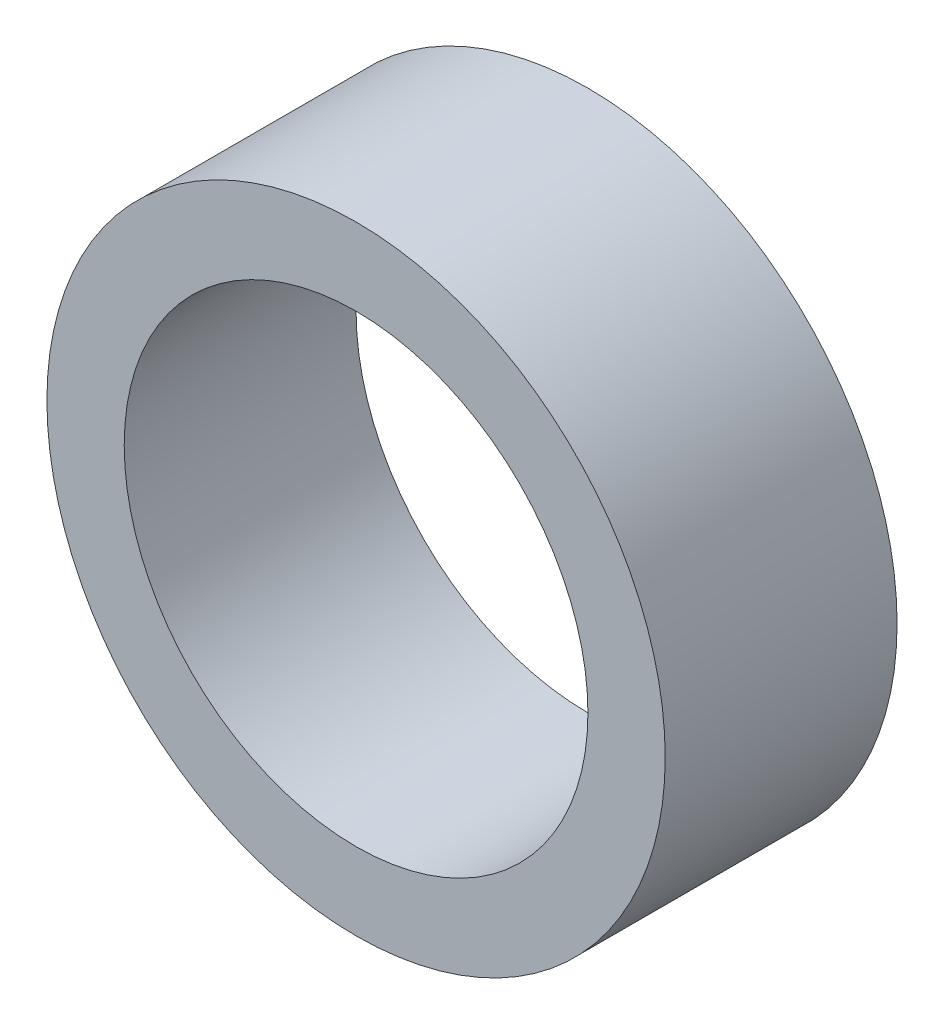
ISO-10303-21;
HEADER;
FILE_DESCRIPTION(('STEP AP214'),'2;1');
FILE_NAME('part.step','',(''),(''),'','','');
FILE_SCHEMA(('AUTOMOTIVE_DESIGN { 1 0 10303 214 1 1 1 1 }'));
ENDSEC;
DATA;
#1=APPLICATION_CONTEXT('core data for automotive mechanical design processes');
#2=APPLICATION_PROTOCOL_DEFINITION('international standard','automotive_design',2000,#1);
#3=PRODUCT_CONTEXT('',#1,'mechanical');
#4=PRODUCT('Part','Part','',(#3));
#5=PRODUCT_RELATED_PRODUCT_CATEGORY('part','',(#4));
#6=PRODUCT_DEFINITION_FORMATION('','',#4);
#7=PRODUCT_DEFINITION_CONTEXT('part definition',#1,'design');
#8=PRODUCT_DEFINITION('design','',#6,#7);
#9=PRODUCT_DEFINITION_SHAPE('','',#8);
#10=(LENGTH_UNIT() NAMED_UNIT(*) SI_UNIT(.MILLI.,.METRE.));
#11=(NAMED_UNIT(*) PLANE_ANGLE_UNIT() SI_UNIT($,.RADIAN.));
#12=(NAMED_UNIT(*) SI_UNIT($,.STERADIAN.) SOLID_ANGLE_UNIT());
#13=UNCERTAINTY_MEASURE_WITH_UNIT(LENGTH_MEASURE(1.E-05),#10,'distance_accuracy_value','');
#14=(GEOMETRIC_REPRESENTATION_CONTEXT(3) GLOBAL_UNCERTAINTY_ASSIGNED_CONTEXT((#13)) GLOBAL_UNIT_ASSIGNED_CONTEXT((#10,
#11,#12)) REPRESENTATION_CONTEXT('',''));
#15=CARTESIAN_POINT('',(0.,0.,0.));
#16=DIRECTION('',(0.,0.,1.));
#17=DIRECTION('',(1.,0.,0.));
#18=AXIS2_PLACEMENT_3D('',#15,#16,#17);
#19=CARTESIAN_POINT('',(0.,0.,9.525));
#20=DIRECTION('',(0.,0.,1.));
#21=DIRECTION('',(1.,0.,0.));
#22=AXIS2_PLACEMENT_3D('',#19,#20,#21);
#23=PLANE('',#22);
#24=CARTESIAN_POINT('',(0.,0.,9.525));
#25=DIRECTION('',(0.,0.,1.));
#26=DIRECTION('',(1.,0.,0.));
#27=AXIS2_PLACEMENT_3D('',#24,#25,#26);
#28=CIRCLE('',#27,12.7);
#29=CARTESIAN_POINT('',(12.7,0.,9.525));
#30=VERTEX_POINT('',#29);
#31=EDGE_CURVE('E10',#30,#30,#28,.T.);
#32=ORIENTED_EDGE('',*,*,#31,.T.);
#33=EDGE_LOOP('',(#32));
#34=FACE_BOUND('',#33,.T.);
#35=CARTESIAN_POINT('',(0.,0.,9.525));
#36=DIRECTION('',(0.,0.,1.));
#37=DIRECTION('',(1.,0.,0.));
#38=AXIS2_PLACEMENT_3D('',#35,#36,#37);
#39=CIRCLE('',#38,9.525);
#40=CARTESIAN_POINT('',(9.525,0.,9.525));
#41=VERTEX_POINT('',#40);
#42=EDGE_CURVE('E42',#41,#41,#39,.T.);
#43=ORIENTED_EDGE('',*,*,#42,.F.);
#44=EDGE_LOOP('',(#43));
#45=FACE_BOUND('',#44,.T.);
#46=ADVANCED_FACE('F31',(#34,#45),#23,.T.);
#47=CARTESIAN_POINT('',(0.,0.,0.));
#48=DIRECTION('',(0.,0.,1.));
#49=DIRECTION('',(1.,0.,0.));
#50=AXIS2_PLACEMENT_3D('',#47,#48,#49);
#51=PLANE('',#50);
#52=CARTESIAN_POINT('',(0.,0.,0.));
#53=DIRECTION('',(0.,0.,1.));
#54=DIRECTION('',(1.,0.,0.));
#55=AXIS2_PLACEMENT_3D('',#52,#53,#54);
#56=CIRCLE('',#55,12.7);
#57=CARTESIAN_POINT('',(12.7,0.,0.));
#58=VERTEX_POINT('',#57);
#59=EDGE_CURVE('E35',#58,#58,#56,.T.);
#60=ORIENTED_EDGE('',*,*,#59,.F.);
#61=EDGE_LOOP('',(#60));
#62=FACE_BOUND('',#61,.T.);
#63=CARTESIAN_POINT('',(0.,0.,0.));
#64=DIRECTION('',(0.,0.,1.));
#65=DIRECTION('',(1.,0.,0.));
#66=AXIS2_PLACEMENT_3D('',#63,#64,#65);
#67=CIRCLE('',#66,9.525);
#68=CARTESIAN_POINT('',(9.525,0.,0.));
#69=VERTEX_POINT('',#68);
#70=EDGE_CURVE('E44',#69,#69,#67,.T.);
#71=ORIENTED_EDGE('',*,*,#70,.T.);
#72=EDGE_LOOP('',(#71));
#73=FACE_BOUND('',#72,.T.);
#74=ADVANCED_FACE('F54',(#62,#73),#51,.F.);
#75=CARTESIAN_POINT('',(0.,0.,9.525));
#76=DIRECTION('',(0.,0.,-1.));
#77=DIRECTION('',(-1.,0.,0.));
#78=AXIS2_PLACEMENT_3D('',#75,#76,#77);
#79=CYLINDRICAL_SURFACE('',#78,12.7);
#80=ORIENTED_EDGE('',*,*,#31,.F.);
#81=EDGE_LOOP('',(#80));
#82=FACE_BOUND('',#81,.T.);
#83=ORIENTED_EDGE('',*,*,#59,.T.);
#84=EDGE_LOOP('',(#83));
#85=FACE_BOUND('',#84,.T.);
#86=ADVANCED_FACE('F33',(#82,#85),#79,.T.);
#87=CARTESIAN_POINT('',(0.,0.,9.525));
#88=DIRECTION('',(0.,0.,-1.));
#89=DIRECTION('',(-1.,0.,0.));
#90=AXIS2_PLACEMENT_3D('',#87,#88,#89);
#91=CYLINDRICAL_SURFACE('',#90,9.525);
#92=ORIENTED_EDGE('',*,*,#42,.T.);
#93=EDGE_LOOP('',(#92));
#94=FACE_BOUND('',#93,.T.);
#95=ORIENTED_EDGE('',*,*,#70,.F.);
#96=EDGE_LOOP('',(#95));
#97=FACE_BOUND('',#96,.T.);
#98=ADVANCED_FACE('F50',(#94,#97),#91,.F.);
#99=CLOSED_SHELL('',(#46,#74,#86,#98));
#100=MANIFOLD_SOLID_BREP('B2',#99);
#101=ADVANCED_BREP_SHAPE_REPRESENTATION('',(#18,#100),#14);
#102=SHAPE_DEFINITION_REPRESENTATION(#9,#101);
ENDSEC;
END-ISO-10303-21;
